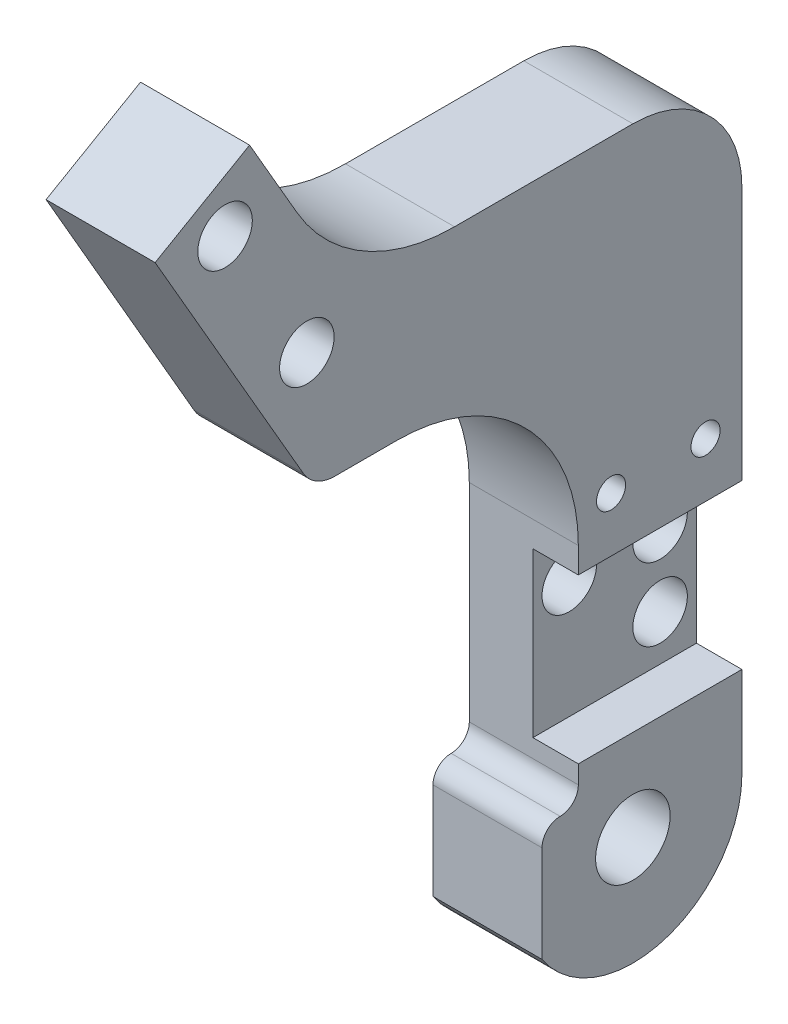
ISO-10303-21;
HEADER;
FILE_DESCRIPTION(('STEP AP214'),'2;1');
FILE_NAME('part.step','',(''),(''),'','','');
FILE_SCHEMA(('AUTOMOTIVE_DESIGN { 1 0 10303 214 1 1 1 1 }'));
ENDSEC;
DATA;
#1=APPLICATION_CONTEXT('core data for automotive mechanical design processes');
#2=APPLICATION_PROTOCOL_DEFINITION('international standard','automotive_design',2000,#1);
#3=PRODUCT_CONTEXT('',#1,'mechanical');
#4=PRODUCT('Part','Part','',(#3));
#5=PRODUCT_RELATED_PRODUCT_CATEGORY('part','',(#4));
#6=PRODUCT_DEFINITION_FORMATION('','',#4);
#7=PRODUCT_DEFINITION_CONTEXT('part definition',#1,'design');
#8=PRODUCT_DEFINITION('design','',#6,#7);
#9=PRODUCT_DEFINITION_SHAPE('','',#8);
#10=(LENGTH_UNIT() NAMED_UNIT(*) SI_UNIT(.MILLI.,.METRE.));
#11=(NAMED_UNIT(*) PLANE_ANGLE_UNIT() SI_UNIT($,.RADIAN.));
#12=(NAMED_UNIT(*) SI_UNIT($,.STERADIAN.) SOLID_ANGLE_UNIT());
#13=UNCERTAINTY_MEASURE_WITH_UNIT(LENGTH_MEASURE(1.E-05),#10,'distance_accuracy_value','');
#14=(GEOMETRIC_REPRESENTATION_CONTEXT(3) GLOBAL_UNCERTAINTY_ASSIGNED_CONTEXT((#13)) GLOBAL_UNIT_ASSIGNED_CONTEXT((#10,
#11,#12)) REPRESENTATION_CONTEXT('',''));
#15=CARTESIAN_POINT('',(0.,0.,0.));
#16=DIRECTION('',(0.,0.,1.));
#17=DIRECTION('',(1.,0.,0.));
#18=AXIS2_PLACEMENT_3D('',#15,#16,#17);
#19=CARTESIAN_POINT('',(0.,0.,0.));
#20=DIRECTION('',(-1.,0.,0.));
#21=DIRECTION('',(0.,0.,1.));
#22=AXIS2_PLACEMENT_3D('',#19,#20,#21);
#23=PLANE('',#22);
#24=CARTESIAN_POINT('',(0.,7.5,-4.));
#25=DIRECTION('',(1.,0.,0.));
#26=DIRECTION('',(0.,0.,-1.));
#27=AXIS2_PLACEMENT_3D('',#24,#25,#26);
#28=CIRCLE('',#27,1.5);
#29=CARTESIAN_POINT('',(0.,7.5,-5.5));
#30=VERTEX_POINT('',#29);
#31=EDGE_CURVE('E223',#30,#30,#28,.T.);
#32=ORIENTED_EDGE('',*,*,#31,.T.);
#33=EDGE_LOOP('',(#32));
#34=FACE_BOUND('',#33,.T.);
#35=CARTESIAN_POINT('',(0.,11.5,1.));
#36=DIRECTION('',(1.,0.,0.));
#37=DIRECTION('',(0.,0.,-1.));
#38=AXIS2_PLACEMENT_3D('',#35,#36,#37);
#39=CIRCLE('',#38,1.5);
#40=CARTESIAN_POINT('',(0.,11.5,-0.5));
#41=VERTEX_POINT('',#40);
#42=EDGE_CURVE('E229',#41,#41,#39,.T.);
#43=ORIENTED_EDGE('',*,*,#42,.T.);
#44=EDGE_LOOP('',(#43));
#45=FACE_BOUND('',#44,.T.);
#46=CARTESIAN_POINT('',(0.,39.8649364905389,22.4379491924311));
#47=DIRECTION('',(1.,0.,0.));
#48=DIRECTION('',(0.,0.,-1.));
#49=AXIS2_PLACEMENT_3D('',#46,#47,#48);
#50=CIRCLE('',#49,1.50000000000001);
#51=CARTESIAN_POINT('',(0.,39.8649364905389,20.9379491924311));
#52=VERTEX_POINT('',#51);
#53=EDGE_CURVE('E236',#52,#52,#50,.T.);
#54=ORIENTED_EDGE('',*,*,#53,.T.);
#55=EDGE_LOOP('',(#54));
#56=FACE_BOUND('',#55,.T.);
#57=DIRECTION('',(0.,-1.,0.));
#58=VECTOR('',#57,1.);
#59=CARTESIAN_POINT('',(0.,3.,5.));
#60=LINE('',#59,#58);
#61=CARTESIAN_POINT('',(0.,2.,5.));
#62=VERTEX_POINT('',#61);
#63=CARTESIAN_POINT('',(0.,-3.3166247903554,5.));
#64=VERTEX_POINT('',#63);
#65=EDGE_CURVE('E255',#62,#64,#60,.T.);
#66=ORIENTED_EDGE('',*,*,#65,.F.);
#67=CARTESIAN_POINT('',(0.,2.,4.));
#68=DIRECTION('',(-1.,0.,0.));
#69=DIRECTION('',(0.,0.,1.));
#70=AXIS2_PLACEMENT_3D('',#67,#68,#69);
#71=CIRCLE('',#70,1.);
#72=CARTESIAN_POINT('',(0.,3.,4.));
#73=VERTEX_POINT('',#72);
#74=EDGE_CURVE('E347',#62,#73,#71,.T.);
#75=ORIENTED_EDGE('',*,*,#74,.T.);
#76=CARTESIAN_POINT('',(0.,4.,4.));
#77=DIRECTION('',(-1.,0.,0.));
#78=DIRECTION('',(0.,0.,1.));
#79=AXIS2_PLACEMENT_3D('',#76,#77,#78);
#80=CIRCLE('',#79,1.);
#81=CARTESIAN_POINT('',(0.,4.,3.));
#82=VERTEX_POINT('',#81);
#83=EDGE_CURVE('E44',#73,#82,#80,.F.);
#84=ORIENTED_EDGE('',*,*,#83,.T.);
#85=DIRECTION('',(0.,-1.,0.));
#86=VECTOR('',#85,1.);
#87=CARTESIAN_POINT('',(0.,15.4051256642758,3.));
#88=LINE('',#87,#86);
#89=CARTESIAN_POINT('',(0.,15.4051256642758,3.));
#90=VERTEX_POINT('',#89);
#91=EDGE_CURVE('E305',#90,#82,#88,.T.);
#92=ORIENTED_EDGE('',*,*,#91,.F.);
#93=CARTESIAN_POINT('',(0.,15.4051256642758,13.));
#94=DIRECTION('',(-1.,0.,0.));
#95=DIRECTION('',(0.,0.,1.));
#96=AXIS2_PLACEMENT_3D('',#93,#94,#95);
#97=CIRCLE('',#96,10.);
#98=CARTESIAN_POINT('',(0.,25.4051256642758,13.));
#99=VERTEX_POINT('',#98);
#100=EDGE_CURVE('E303',#99,#90,#97,.T.);
#101=ORIENTED_EDGE('',*,*,#100,.F.);
#102=DIRECTION('',(0.,0.,-1.));
#103=VECTOR('',#102,1.);
#104=CARTESIAN_POINT('',(0.,25.4051256642759,16.3989745962154));
#105=LINE('',#104,#103);
#106=CARTESIAN_POINT('',(0.,25.4051256642759,16.3989745962154));
#107=VERTEX_POINT('',#106);
#108=EDGE_CURVE('E301',#107,#99,#105,.T.);
#109=ORIENTED_EDGE('',*,*,#108,.F.);
#110=CARTESIAN_POINT('',(0.,27.4051256642758,16.3989745962155));
#111=DIRECTION('',(1.,0.,0.));
#112=DIRECTION('',(0.,0.,-1.));
#113=AXIS2_PLACEMENT_3D('',#110,#111,#112);
#114=CIRCLE('',#113,1.99999999999995);
#115=CARTESIAN_POINT('',(0.,26.4051256642758,18.1310254037843));
#116=VERTEX_POINT('',#115);
#117=EDGE_CURVE('E299',#116,#107,#114,.T.);
#118=ORIENTED_EDGE('',*,*,#117,.F.);
#119=DIRECTION('',(0.,-0.866025403784435,-0.500000000000006));
#120=VECTOR('',#119,1.);
#121=CARTESIAN_POINT('',(0.,40.53,26.2860254037844));
#122=LINE('',#121,#120);
#123=CARTESIAN_POINT('',(0.,40.53,26.2860254037844));
#124=VERTEX_POINT('',#123);
#125=EDGE_CURVE('E297',#124,#116,#122,.T.);
#126=ORIENTED_EDGE('',*,*,#125,.F.);
#127=DIRECTION('',(0.,-0.500000000000005,0.866025403784436));
#128=VECTOR('',#127,1.);
#129=CARTESIAN_POINT('',(0.,43.53,21.0898729810778));
#130=LINE('',#129,#128);
#131=CARTESIAN_POINT('',(0.,43.53,21.0898729810778));
#132=VERTEX_POINT('',#131);
#133=EDGE_CURVE('E295',#132,#124,#130,.T.);
#134=ORIENTED_EDGE('',*,*,#133,.F.);
#135=DIRECTION('',(0.,0.866025403784436,0.500000000000004));
#136=VECTOR('',#135,1.);
#137=CARTESIAN_POINT('',(0.,39.,18.4744762616488));
#138=LINE('',#137,#136);
#139=CARTESIAN_POINT('',(0.,39.,18.4744762616488));
#140=VERTEX_POINT('',#139);
#141=EDGE_CURVE('E293',#140,#132,#138,.T.);
#142=ORIENTED_EDGE('',*,*,#141,.F.);
#143=CARTESIAN_POINT('',(0.,44.,9.8142222238044));
#144=DIRECTION('',(-1.,0.,0.));
#145=DIRECTION('',(0.,0.,1.));
#146=AXIS2_PLACEMENT_3D('',#143,#144,#145);
#147=CIRCLE('',#146,10.);
#148=CARTESIAN_POINT('',(0.,34.,9.81422222380439));
#149=VERTEX_POINT('',#148);
#150=EDGE_CURVE('E291',#149,#140,#147,.T.);
#151=ORIENTED_EDGE('',*,*,#150,.F.);
#152=DIRECTION('',(0.,0.,1.));
#153=VECTOR('',#152,1.);
#154=CARTESIAN_POINT('',(0.,34.,0.));
#155=LINE('',#154,#153);
#156=CARTESIAN_POINT('',(0.,34.,0.));
#157=VERTEX_POINT('',#156);
#158=EDGE_CURVE('E289',#157,#149,#155,.T.);
#159=ORIENTED_EDGE('',*,*,#158,.F.);
#160=CARTESIAN_POINT('',(0.,28.,0.));
#161=DIRECTION('',(1.,0.,0.));
#162=DIRECTION('',(0.,0.,-1.));
#163=AXIS2_PLACEMENT_3D('',#160,#161,#162);
#164=CIRCLE('',#163,6.);
#165=CARTESIAN_POINT('',(0.,28.,-6.));
#166=VERTEX_POINT('',#165);
#167=EDGE_CURVE('E287',#166,#157,#164,.T.);
#168=ORIENTED_EDGE('',*,*,#167,.F.);
#169=DIRECTION('',(0.,1.,0.));
#170=VECTOR('',#169,1.);
#171=CARTESIAN_POINT('',(0.,0.,-6.));
#172=LINE('',#171,#170);
#173=CARTESIAN_POINT('',(0.,0.,-6.));
#174=VERTEX_POINT('',#173);
#175=EDGE_CURVE('E285',#174,#166,#172,.T.);
#176=ORIENTED_EDGE('',*,*,#175,.F.);
#177=CARTESIAN_POINT('',(0.,0.,0.));
#178=DIRECTION('',(1.,0.,0.));
#179=DIRECTION('',(0.,0.,1.));
#180=AXIS2_PLACEMENT_3D('',#177,#178,#179);
#181=CIRCLE('',#180,6.);
#182=EDGE_CURVE('E248',#64,#174,#181,.T.);
#183=ORIENTED_EDGE('',*,*,#182,.F.);
#184=EDGE_LOOP('',(#66,#75,#84,#92,#101,#109,#118,#126,#134,#142,#151,#159,#168,#176,#183));
#185=FACE_BOUND('',#184,.T.);
#186=CARTESIAN_POINT('',(0.,0.,0.));
#187=DIRECTION('',(1.,0.,0.));
#188=DIRECTION('',(0.,0.,-1.));
#189=AXIS2_PLACEMENT_3D('',#186,#187,#188);
#190=CIRCLE('',#189,2.05);
#191=CARTESIAN_POINT('',(0.,0.,-2.05));
#192=VERTEX_POINT('',#191);
#193=EDGE_CURVE('E242',#192,#192,#190,.T.);
#194=ORIENTED_EDGE('',*,*,#193,.T.);
#195=EDGE_LOOP('',(#194));
#196=FACE_BOUND('',#195,.T.);
#197=CARTESIAN_POINT('',(0.,32.070707856479,17.9379491924311));
#198=DIRECTION('',(1.,0.,0.));
#199=DIRECTION('',(0.,0.,-1.));
#200=AXIS2_PLACEMENT_3D('',#197,#198,#199);
#201=CIRCLE('',#200,1.50000000000001);
#202=CARTESIAN_POINT('',(0.,32.070707856479,16.4379491924311));
#203=VERTEX_POINT('',#202);
#204=EDGE_CURVE('E232',#203,#203,#201,.T.);
#205=ORIENTED_EDGE('',*,*,#204,.T.);
#206=EDGE_LOOP('',(#205));
#207=FACE_BOUND('',#206,.T.);
#208=CARTESIAN_POINT('',(0.,11.5,-4.));
#209=DIRECTION('',(1.,0.,0.));
#210=DIRECTION('',(0.,0.,-1.));
#211=AXIS2_PLACEMENT_3D('',#208,#209,#210);
#212=CIRCLE('',#211,1.5);
#213=CARTESIAN_POINT('',(0.,11.5,-5.5));
#214=VERTEX_POINT('',#213);
#215=EDGE_CURVE('E226',#214,#214,#212,.T.);
#216=ORIENTED_EDGE('',*,*,#215,.T.);
#217=EDGE_LOOP('',(#216));
#218=FACE_BOUND('',#217,.T.);
#219=CARTESIAN_POINT('',(0.,17.,-4.));
#220=DIRECTION('',(-1.,0.,0.));
#221=DIRECTION('',(0.,0.,1.));
#222=AXIS2_PLACEMENT_3D('',#219,#220,#221);
#223=CIRCLE('',#222,0.799999999999993);
#224=CARTESIAN_POINT('',(0.,17.,-3.20000000000001));
#225=VERTEX_POINT('',#224);
#226=EDGE_CURVE('E219',#225,#225,#223,.T.);
#227=ORIENTED_EDGE('',*,*,#226,.F.);
#228=EDGE_LOOP('',(#227));
#229=FACE_BOUND('',#228,.T.);
#230=CARTESIAN_POINT('',(0.,17.,1.2));
#231=DIRECTION('',(-1.,0.,0.));
#232=DIRECTION('',(0.,0.,1.));
#233=AXIS2_PLACEMENT_3D('',#230,#231,#232);
#234=CIRCLE('',#233,0.799999999999993);
#235=CARTESIAN_POINT('',(0.,17.,1.99999999999999));
#236=VERTEX_POINT('',#235);
#237=EDGE_CURVE('E213',#236,#236,#234,.T.);
#238=ORIENTED_EDGE('',*,*,#237,.F.);
#239=EDGE_LOOP('',(#238));
#240=FACE_BOUND('',#239,.T.);
#241=CARTESIAN_POINT('',(0.,28.,0.));
#242=DIRECTION('',(1.,0.,0.));
#243=DIRECTION('',(0.,0.,-1.));
#244=AXIS2_PLACEMENT_3D('',#241,#242,#243);
#245=CIRCLE('',#244,5.);
#246=CARTESIAN_POINT('',(0.,28.,-5.));
#247=VERTEX_POINT('',#246);
#248=EDGE_CURVE('E192',#247,#247,#245,.T.);
#249=ORIENTED_EDGE('',*,*,#248,.T.);
#250=EDGE_LOOP('',(#249));
#251=FACE_BOUND('',#250,.T.);
#252=ADVANCED_FACE('F35',(#34,#45,#56,#185,#196,#207,#218,#229,#240,#251),#23,.T.);
#253=CARTESIAN_POINT('',(6.,0.,0.));
#254=DIRECTION('',(-1.,0.,0.));
#255=DIRECTION('',(0.,0.,1.));
#256=AXIS2_PLACEMENT_3D('',#253,#254,#255);
#257=PLANE('',#256);
#258=CARTESIAN_POINT('',(6.,0.,0.));
#259=DIRECTION('',(1.,0.,0.));
#260=DIRECTION('',(0.,0.,-1.));
#261=AXIS2_PLACEMENT_3D('',#258,#259,#260);
#262=CIRCLE('',#261,2.05);
#263=CARTESIAN_POINT('',(6.,0.,-2.05));
#264=VERTEX_POINT('',#263);
#265=EDGE_CURVE('E245',#264,#264,#262,.T.);
#266=ORIENTED_EDGE('',*,*,#265,.F.);
#267=EDGE_LOOP('',(#266));
#268=FACE_BOUND('',#267,.T.);
#269=DIRECTION('',(0.,0.,1.));
#270=VECTOR('',#269,1.);
#271=CARTESIAN_POINT('',(6.,5.,-6.));
#272=LINE('',#271,#270);
#273=CARTESIAN_POINT('',(6.,5.,-6.));
#274=VERTEX_POINT('',#273);
#275=CARTESIAN_POINT('',(6.,5.,3.));
#276=VERTEX_POINT('',#275);
#277=EDGE_CURVE('E179',#274,#276,#272,.T.);
#278=ORIENTED_EDGE('',*,*,#277,.T.);
#279=DIRECTION('',(0.,-1.,0.));
#280=VECTOR('',#279,1.);
#281=CARTESIAN_POINT('',(6.,15.4051256642758,3.));
#282=LINE('',#281,#280);
#283=CARTESIAN_POINT('',(6.,4.,3.));
#284=VERTEX_POINT('',#283);
#285=EDGE_CURVE('E276',#276,#284,#282,.T.);
#286=ORIENTED_EDGE('',*,*,#285,.T.);
#287=CARTESIAN_POINT('',(6.,4.,4.));
#288=DIRECTION('',(-1.,0.,0.));
#289=DIRECTION('',(0.,0.,1.));
#290=AXIS2_PLACEMENT_3D('',#287,#288,#289);
#291=CIRCLE('',#290,1.);
#292=CARTESIAN_POINT('',(6.,3.,4.));
#293=VERTEX_POINT('',#292);
#294=EDGE_CURVE('E11',#284,#293,#291,.T.);
#295=ORIENTED_EDGE('',*,*,#294,.T.);
#296=CARTESIAN_POINT('',(6.,2.,4.));
#297=DIRECTION('',(-1.,0.,0.));
#298=DIRECTION('',(0.,0.,1.));
#299=AXIS2_PLACEMENT_3D('',#296,#297,#298);
#300=CIRCLE('',#299,1.);
#301=CARTESIAN_POINT('',(6.,2.,5.));
#302=VERTEX_POINT('',#301);
#303=EDGE_CURVE('E349',#293,#302,#300,.F.);
#304=ORIENTED_EDGE('',*,*,#303,.T.);
#305=DIRECTION('',(0.,-1.,0.));
#306=VECTOR('',#305,1.);
#307=CARTESIAN_POINT('',(6.,3.,5.));
#308=LINE('',#307,#306);
#309=CARTESIAN_POINT('',(6.,-3.3166247903554,5.));
#310=VERTEX_POINT('',#309);
#311=EDGE_CURVE('E280',#302,#310,#308,.T.);
#312=ORIENTED_EDGE('',*,*,#311,.T.);
#313=CARTESIAN_POINT('',(6.,0.,0.));
#314=DIRECTION('',(1.,0.,0.));
#315=DIRECTION('',(0.,0.,1.));
#316=AXIS2_PLACEMENT_3D('',#313,#314,#315);
#317=CIRCLE('',#316,6.);
#318=CARTESIAN_POINT('',(6.,0.,-6.));
#319=VERTEX_POINT('',#318);
#320=EDGE_CURVE('E251',#310,#319,#317,.T.);
#321=ORIENTED_EDGE('',*,*,#320,.T.);
#322=DIRECTION('',(0.,1.,0.));
#323=VECTOR('',#322,1.);
#324=CARTESIAN_POINT('',(6.,0.,-6.));
#325=LINE('',#324,#323);
#326=EDGE_CURVE('E256',#319,#274,#325,.T.);
#327=ORIENTED_EDGE('',*,*,#326,.T.);
#328=EDGE_LOOP('',(#278,#286,#295,#304,#312,#321,#327));
#329=FACE_BOUND('',#328,.T.);
#330=ADVANCED_FACE('F425',(#268,#329),#257,.F.);
#331=CARTESIAN_POINT('',(6.,17.,1.2));
#332=DIRECTION('',(1.,0.,0.));
#333=DIRECTION('',(0.,0.,-1.));
#334=AXIS2_PLACEMENT_3D('',#331,#332,#333);
#335=CIRCLE('',#334,0.799999999999988);
#336=CARTESIAN_POINT('',(6.,17.,0.400000000000011));
#337=VERTEX_POINT('',#336);
#338=EDGE_CURVE('E210',#337,#337,#335,.T.);
#339=ORIENTED_EDGE('',*,*,#338,.F.);
#340=EDGE_LOOP('',(#339));
#341=FACE_BOUND('',#340,.T.);
#342=CARTESIAN_POINT('',(6.,17.,-4.));
#343=DIRECTION('',(1.,0.,0.));
#344=DIRECTION('',(0.,0.,-1.));
#345=AXIS2_PLACEMENT_3D('',#342,#343,#344);
#346=CIRCLE('',#345,0.799999999999988);
#347=CARTESIAN_POINT('',(6.,17.,-4.79999999999999));
#348=VERTEX_POINT('',#347);
#349=EDGE_CURVE('E216',#348,#348,#346,.T.);
#350=ORIENTED_EDGE('',*,*,#349,.F.);
#351=EDGE_LOOP('',(#350));
#352=FACE_BOUND('',#351,.T.);
#353=CARTESIAN_POINT('',(6.,32.070707856479,17.9379491924311));
#354=DIRECTION('',(1.,0.,0.));
#355=DIRECTION('',(0.,0.,-1.));
#356=AXIS2_PLACEMENT_3D('',#353,#354,#355);
#357=CIRCLE('',#356,1.50000000000001);
#358=CARTESIAN_POINT('',(6.,32.070707856479,16.4379491924311));
#359=VERTEX_POINT('',#358);
#360=EDGE_CURVE('E233',#359,#359,#357,.T.);
#361=ORIENTED_EDGE('',*,*,#360,.F.);
#362=EDGE_LOOP('',(#361));
#363=FACE_BOUND('',#362,.T.);
#364=CARTESIAN_POINT('',(6.,39.8649364905389,22.4379491924311));
#365=DIRECTION('',(1.,0.,0.));
#366=DIRECTION('',(0.,0.,-1.));
#367=AXIS2_PLACEMENT_3D('',#364,#365,#366);
#368=CIRCLE('',#367,1.50000000000001);
#369=CARTESIAN_POINT('',(6.,39.8649364905389,20.9379491924311));
#370=VERTEX_POINT('',#369);
#371=EDGE_CURVE('E239',#370,#370,#368,.T.);
#372=ORIENTED_EDGE('',*,*,#371,.F.);
#373=EDGE_LOOP('',(#372));
#374=FACE_BOUND('',#373,.T.);
#375=DIRECTION('',(0.,0.,-1.));
#376=VECTOR('',#375,1.);
#377=CARTESIAN_POINT('',(6.,14.,-6.));
#378=LINE('',#377,#376);
#379=CARTESIAN_POINT('',(6.,14.,3.));
#380=VERTEX_POINT('',#379);
#381=CARTESIAN_POINT('',(6.,14.,-6.));
#382=VERTEX_POINT('',#381);
#383=EDGE_CURVE('E187',#380,#382,#378,.T.);
#384=ORIENTED_EDGE('',*,*,#383,.T.);
#385=CARTESIAN_POINT('',(6.,28.,-6.));
#386=VERTEX_POINT('',#385);
#387=EDGE_CURVE('E254',#382,#386,#325,.T.);
#388=ORIENTED_EDGE('',*,*,#387,.T.);
#389=CARTESIAN_POINT('',(6.,28.,0.));
#390=DIRECTION('',(1.,0.,0.));
#391=DIRECTION('',(0.,0.,-1.));
#392=AXIS2_PLACEMENT_3D('',#389,#390,#391);
#393=CIRCLE('',#392,6.);
#394=CARTESIAN_POINT('',(6.,34.,0.));
#395=VERTEX_POINT('',#394);
#396=EDGE_CURVE('E258',#386,#395,#393,.T.);
#397=ORIENTED_EDGE('',*,*,#396,.T.);
#398=DIRECTION('',(0.,0.,1.));
#399=VECTOR('',#398,1.);
#400=CARTESIAN_POINT('',(6.,34.,0.));
#401=LINE('',#400,#399);
#402=CARTESIAN_POINT('',(6.,34.,9.81422222380439));
#403=VERTEX_POINT('',#402);
#404=EDGE_CURVE('E260',#395,#403,#401,.T.);
#405=ORIENTED_EDGE('',*,*,#404,.T.);
#406=CARTESIAN_POINT('',(6.,44.,9.8142222238044));
#407=DIRECTION('',(-1.,0.,0.));
#408=DIRECTION('',(0.,0.,1.));
#409=AXIS2_PLACEMENT_3D('',#406,#407,#408);
#410=CIRCLE('',#409,10.);
#411=CARTESIAN_POINT('',(6.,39.,18.4744762616488));
#412=VERTEX_POINT('',#411);
#413=EDGE_CURVE('E262',#403,#412,#410,.T.);
#414=ORIENTED_EDGE('',*,*,#413,.T.);
#415=DIRECTION('',(0.,0.866025403784436,0.500000000000004));
#416=VECTOR('',#415,1.);
#417=CARTESIAN_POINT('',(6.,39.,18.4744762616488));
#418=LINE('',#417,#416);
#419=CARTESIAN_POINT('',(6.,43.53,21.0898729810778));
#420=VERTEX_POINT('',#419);
#421=EDGE_CURVE('E264',#412,#420,#418,.T.);
#422=ORIENTED_EDGE('',*,*,#421,.T.);
#423=DIRECTION('',(0.,-0.500000000000005,0.866025403784436));
#424=VECTOR('',#423,1.);
#425=CARTESIAN_POINT('',(6.,43.53,21.0898729810778));
#426=LINE('',#425,#424);
#427=CARTESIAN_POINT('',(6.,40.53,26.2860254037844));
#428=VERTEX_POINT('',#427);
#429=EDGE_CURVE('E266',#420,#428,#426,.T.);
#430=ORIENTED_EDGE('',*,*,#429,.T.);
#431=DIRECTION('',(0.,-0.866025403784435,-0.500000000000006));
#432=VECTOR('',#431,1.);
#433=CARTESIAN_POINT('',(6.,40.53,26.2860254037844));
#434=LINE('',#433,#432);
#435=CARTESIAN_POINT('',(6.,26.4051256642758,18.1310254037843));
#436=VERTEX_POINT('',#435);
#437=EDGE_CURVE('E268',#428,#436,#434,.T.);
#438=ORIENTED_EDGE('',*,*,#437,.T.);
#439=CARTESIAN_POINT('',(6.,27.4051256642758,16.3989745962155));
#440=DIRECTION('',(1.,0.,0.));
#441=DIRECTION('',(0.,0.,-1.));
#442=AXIS2_PLACEMENT_3D('',#439,#440,#441);
#443=CIRCLE('',#442,1.99999999999995);
#444=CARTESIAN_POINT('',(6.,25.4051256642759,16.3989745962154));
#445=VERTEX_POINT('',#444);
#446=EDGE_CURVE('E270',#436,#445,#443,.T.);
#447=ORIENTED_EDGE('',*,*,#446,.T.);
#448=DIRECTION('',(0.,0.,-1.));
#449=VECTOR('',#448,1.);
#450=CARTESIAN_POINT('',(6.,25.4051256642759,16.3989745962154));
#451=LINE('',#450,#449);
#452=CARTESIAN_POINT('',(6.,25.4051256642758,13.));
#453=VERTEX_POINT('',#452);
#454=EDGE_CURVE('E272',#445,#453,#451,.T.);
#455=ORIENTED_EDGE('',*,*,#454,.T.);
#456=CARTESIAN_POINT('',(6.,15.4051256642758,13.));
#457=DIRECTION('',(-1.,0.,0.));
#458=DIRECTION('',(0.,0.,1.));
#459=AXIS2_PLACEMENT_3D('',#456,#457,#458);
#460=CIRCLE('',#459,10.);
#461=CARTESIAN_POINT('',(6.,15.4051256642758,3.));
#462=VERTEX_POINT('',#461);
#463=EDGE_CURVE('E274',#453,#462,#460,.T.);
#464=ORIENTED_EDGE('',*,*,#463,.T.);
#465=EDGE_CURVE('E277',#462,#380,#282,.T.);
#466=ORIENTED_EDGE('',*,*,#465,.T.);
#467=EDGE_LOOP('',(#384,#388,#397,#405,#414,#422,#430,#438,#447,#455,#464,#466));
#468=FACE_BOUND('',#467,.T.);
#469=ADVANCED_FACE('F428',(#341,#352,#363,#374,#468),#257,.F.);
#470=CARTESIAN_POINT('',(6.,0.,-6.));
#471=DIRECTION('',(0.,0.,1.));
#472=DIRECTION('',(0.,-1.,0.));
#473=AXIS2_PLACEMENT_3D('',#470,#471,#472);
#474=PLANE('',#473);
#475=DIRECTION('',(1.,0.,0.));
#476=VECTOR('',#475,1.);
#477=CARTESIAN_POINT('',(3.5,5.,-6.));
#478=LINE('',#477,#476);
#479=CARTESIAN_POINT('',(3.5,5.,-6.));
#480=VERTEX_POINT('',#479);
#481=EDGE_CURVE('E176',#480,#274,#478,.T.);
#482=ORIENTED_EDGE('',*,*,#481,.T.);
#483=ORIENTED_EDGE('',*,*,#326,.F.);
#484=DIRECTION('',(-1.,0.,0.));
#485=VECTOR('',#484,1.);
#486=CARTESIAN_POINT('',(6.,0.,-6.));
#487=LINE('',#486,#485);
#488=EDGE_CURVE('E341',#319,#174,#487,.T.);
#489=ORIENTED_EDGE('',*,*,#488,.T.);
#490=ORIENTED_EDGE('',*,*,#175,.T.);
#491=DIRECTION('',(-1.,0.,0.));
#492=VECTOR('',#491,1.);
#493=CARTESIAN_POINT('',(6.,28.,-6.));
#494=LINE('',#493,#492);
#495=EDGE_CURVE('E338',#386,#166,#494,.T.);
#496=ORIENTED_EDGE('',*,*,#495,.F.);
#497=ORIENTED_EDGE('',*,*,#387,.F.);
#498=DIRECTION('',(1.,0.,0.));
#499=VECTOR('',#498,1.);
#500=CARTESIAN_POINT('',(3.5,14.,-6.));
#501=LINE('',#500,#499);
#502=CARTESIAN_POINT('',(3.5,14.,-6.));
#503=VERTEX_POINT('',#502);
#504=EDGE_CURVE('E186',#503,#382,#501,.T.);
#505=ORIENTED_EDGE('',*,*,#504,.F.);
#506=DIRECTION('',(0.,-1.,0.));
#507=VECTOR('',#506,1.);
#508=CARTESIAN_POINT('',(3.5,5.,-6.));
#509=LINE('',#508,#507);
#510=EDGE_CURVE('E168',#503,#480,#509,.T.);
#511=ORIENTED_EDGE('',*,*,#510,.T.);
#512=EDGE_LOOP('',(#482,#483,#489,#490,#496,#497,#505,#511));
#513=FACE_BOUND('',#512,.T.);
#514=ADVANCED_FACE('F184',(#513),#474,.F.);
#515=CARTESIAN_POINT('',(6.,15.4051256642758,3.));
#516=DIRECTION('',(0.,0.,-1.));
#517=DIRECTION('',(0.,1.,0.));
#518=AXIS2_PLACEMENT_3D('',#515,#516,#517);
#519=PLANE('',#518);
#520=DIRECTION('',(1.,0.,0.));
#521=VECTOR('',#520,1.);
#522=CARTESIAN_POINT('',(3.5,5.,3.));
#523=LINE('',#522,#521);
#524=CARTESIAN_POINT('',(3.5,5.,3.));
#525=VERTEX_POINT('',#524);
#526=EDGE_CURVE('E182',#525,#276,#523,.T.);
#527=ORIENTED_EDGE('',*,*,#526,.F.);
#528=DIRECTION('',(0.,1.,0.));
#529=VECTOR('',#528,1.);
#530=CARTESIAN_POINT('',(3.5,5.,3.));
#531=LINE('',#530,#529);
#532=CARTESIAN_POINT('',(3.5,14.,3.));
#533=VERTEX_POINT('',#532);
#534=EDGE_CURVE('E171',#525,#533,#531,.T.);
#535=ORIENTED_EDGE('',*,*,#534,.T.);
#536=DIRECTION('',(1.,0.,0.));
#537=VECTOR('',#536,1.);
#538=CARTESIAN_POINT('',(3.5,14.,3.));
#539=LINE('',#538,#537);
#540=EDGE_CURVE('E200',#533,#380,#539,.T.);
#541=ORIENTED_EDGE('',*,*,#540,.T.);
#542=ORIENTED_EDGE('',*,*,#465,.F.);
#543=DIRECTION('',(-1.,0.,0.));
#544=VECTOR('',#543,1.);
#545=CARTESIAN_POINT('',(6.,15.4051256642758,3.));
#546=LINE('',#545,#544);
#547=EDGE_CURVE('E311',#462,#90,#546,.T.);
#548=ORIENTED_EDGE('',*,*,#547,.T.);
#549=ORIENTED_EDGE('',*,*,#91,.T.);
#550=DIRECTION('',(-1.,0.,0.));
#551=VECTOR('',#550,1.);
#552=CARTESIAN_POINT('',(6.,4.,3.));
#553=LINE('',#552,#551);
#554=EDGE_CURVE('E351',#82,#284,#553,.F.);
#555=ORIENTED_EDGE('',*,*,#554,.T.);
#556=ORIENTED_EDGE('',*,*,#285,.F.);
#557=EDGE_LOOP('',(#527,#535,#541,#542,#548,#549,#555,#556));
#558=FACE_BOUND('',#557,.T.);
#559=ADVANCED_FACE('F368',(#558),#519,.F.);
#560=CARTESIAN_POINT('',(6.,11.5,1.));
#561=DIRECTION('',(-1.,0.,0.));
#562=DIRECTION('',(0.,0.,1.));
#563=AXIS2_PLACEMENT_3D('',#560,#561,#562);
#564=CYLINDRICAL_SURFACE('',#563,1.5);
#565=ORIENTED_EDGE('',*,*,#42,.F.);
#566=EDGE_LOOP('',(#565));
#567=FACE_BOUND('',#566,.T.);
#568=CARTESIAN_POINT('',(3.5,11.5,1.));
#569=DIRECTION('',(1.,0.,0.));
#570=DIRECTION('',(0.,0.,-1.));
#571=AXIS2_PLACEMENT_3D('',#568,#569,#570);
#572=CIRCLE('',#571,1.5);
#573=CARTESIAN_POINT('',(3.5,11.5,-0.5));
#574=VERTEX_POINT('',#573);
#575=EDGE_CURVE('E207',#574,#574,#572,.T.);
#576=ORIENTED_EDGE('',*,*,#575,.T.);
#577=EDGE_LOOP('',(#576));
#578=FACE_BOUND('',#577,.T.);
#579=ADVANCED_FACE('F457',(#567,#578),#564,.F.);
#580=CARTESIAN_POINT('',(6.,11.5,-4.));
#581=DIRECTION('',(-1.,0.,0.));
#582=DIRECTION('',(0.,0.,1.));
#583=AXIS2_PLACEMENT_3D('',#580,#581,#582);
#584=CYLINDRICAL_SURFACE('',#583,1.5);
#585=ORIENTED_EDGE('',*,*,#215,.F.);
#586=EDGE_LOOP('',(#585));
#587=FACE_BOUND('',#586,.T.);
#588=CARTESIAN_POINT('',(3.5,11.5,-4.));
#589=DIRECTION('',(1.,0.,0.));
#590=DIRECTION('',(0.,0.,-1.));
#591=AXIS2_PLACEMENT_3D('',#588,#589,#590);
#592=CIRCLE('',#591,1.5);
#593=CARTESIAN_POINT('',(3.5,11.5,-5.5));
#594=VERTEX_POINT('',#593);
#595=EDGE_CURVE('E204',#594,#594,#592,.T.);
#596=ORIENTED_EDGE('',*,*,#595,.T.);
#597=EDGE_LOOP('',(#596));
#598=FACE_BOUND('',#597,.T.);
#599=ADVANCED_FACE('F570',(#587,#598),#584,.F.);
#600=CARTESIAN_POINT('',(6.,7.5,-4.));
#601=DIRECTION('',(-1.,0.,0.));
#602=DIRECTION('',(0.,0.,1.));
#603=AXIS2_PLACEMENT_3D('',#600,#601,#602);
#604=CYLINDRICAL_SURFACE('',#603,1.5);
#605=ORIENTED_EDGE('',*,*,#31,.F.);
#606=EDGE_LOOP('',(#605));
#607=FACE_BOUND('',#606,.T.);
#608=CARTESIAN_POINT('',(3.5,7.5,-4.));
#609=DIRECTION('',(1.,0.,0.));
#610=DIRECTION('',(0.,0.,-1.));
#611=AXIS2_PLACEMENT_3D('',#608,#609,#610);
#612=CIRCLE('',#611,1.5);
#613=CARTESIAN_POINT('',(3.5,7.5,-5.5));
#614=VERTEX_POINT('',#613);
#615=EDGE_CURVE('E39',#614,#614,#612,.T.);
#616=ORIENTED_EDGE('',*,*,#615,.T.);
#617=EDGE_LOOP('',(#616));
#618=FACE_BOUND('',#617,.T.);
#619=ADVANCED_FACE('F479',(#607,#618),#604,.F.);
#620=CARTESIAN_POINT('',(6.,0.,0.));
#621=DIRECTION('',(-1.,0.,0.));
#622=DIRECTION('',(0.,0.,1.));
#623=AXIS2_PLACEMENT_3D('',#620,#621,#622);
#624=CYLINDRICAL_SURFACE('',#623,6.);
#625=ORIENTED_EDGE('',*,*,#182,.T.);
#626=ORIENTED_EDGE('',*,*,#488,.F.);
#627=ORIENTED_EDGE('',*,*,#320,.F.);
#628=DIRECTION('',(-1.,0.,0.));
#629=VECTOR('',#628,1.);
#630=CARTESIAN_POINT('',(6.,-3.3166247903554,5.));
#631=LINE('',#630,#629);
#632=EDGE_CURVE('E282',#310,#64,#631,.T.);
#633=ORIENTED_EDGE('',*,*,#632,.T.);
#634=EDGE_LOOP('',(#625,#626,#627,#633));
#635=FACE_BOUND('',#634,.T.);
#636=ADVANCED_FACE('F419',(#635),#624,.T.);
#637=CARTESIAN_POINT('',(6.,28.,0.));
#638=DIRECTION('',(-1.,0.,0.));
#639=DIRECTION('',(0.,0.,1.));
#640=AXIS2_PLACEMENT_3D('',#637,#638,#639);
#641=CYLINDRICAL_SURFACE('',#640,6.);
#642=ORIENTED_EDGE('',*,*,#167,.T.);
#643=DIRECTION('',(-1.,0.,0.));
#644=VECTOR('',#643,1.);
#645=CARTESIAN_POINT('',(6.,34.,0.));
#646=LINE('',#645,#644);
#647=EDGE_CURVE('E335',#395,#157,#646,.T.);
#648=ORIENTED_EDGE('',*,*,#647,.F.);
#649=ORIENTED_EDGE('',*,*,#396,.F.);
#650=ORIENTED_EDGE('',*,*,#495,.T.);
#651=EDGE_LOOP('',(#642,#648,#649,#650));
#652=FACE_BOUND('',#651,.T.);
#653=ADVANCED_FACE('F414',(#652),#641,.T.);
#654=CARTESIAN_POINT('',(6.,34.,0.));
#655=DIRECTION('',(0.,-1.,0.));
#656=DIRECTION('',(0.,0.,-1.));
#657=AXIS2_PLACEMENT_3D('',#654,#655,#656);
#658=PLANE('',#657);
#659=ORIENTED_EDGE('',*,*,#158,.T.);
#660=DIRECTION('',(-1.,0.,0.));
#661=VECTOR('',#660,1.);
#662=CARTESIAN_POINT('',(6.,34.,9.81422222380439));
#663=LINE('',#662,#661);
#664=EDGE_CURVE('E332',#403,#149,#663,.T.);
#665=ORIENTED_EDGE('',*,*,#664,.F.);
#666=ORIENTED_EDGE('',*,*,#404,.F.);
#667=ORIENTED_EDGE('',*,*,#647,.T.);
#668=EDGE_LOOP('',(#659,#665,#666,#667));
#669=FACE_BOUND('',#668,.T.);
#670=ADVANCED_FACE('F409',(#669),#658,.F.);
#671=CARTESIAN_POINT('',(6.,44.,9.8142222238044));
#672=DIRECTION('',(-1.,0.,0.));
#673=DIRECTION('',(0.,0.,1.));
#674=AXIS2_PLACEMENT_3D('',#671,#672,#673);
#675=CYLINDRICAL_SURFACE('',#674,10.);
#676=ORIENTED_EDGE('',*,*,#150,.T.);
#677=DIRECTION('',(-1.,0.,0.));
#678=VECTOR('',#677,1.);
#679=CARTESIAN_POINT('',(6.,39.,18.4744762616488));
#680=LINE('',#679,#678);
#681=EDGE_CURVE('E329',#412,#140,#680,.T.);
#682=ORIENTED_EDGE('',*,*,#681,.F.);
#683=ORIENTED_EDGE('',*,*,#413,.F.);
#684=ORIENTED_EDGE('',*,*,#664,.T.);
#685=EDGE_LOOP('',(#676,#682,#683,#684));
#686=FACE_BOUND('',#685,.T.);
#687=ADVANCED_FACE('F404',(#686),#675,.F.);
#688=CARTESIAN_POINT('',(6.,39.,18.4744762616488));
#689=DIRECTION('',(0.,-0.500000000000004,0.866025403784436));
#690=DIRECTION('',(0.,-0.866025403784436,-0.500000000000004));
#691=AXIS2_PLACEMENT_3D('',#688,#689,#690);
#692=PLANE('',#691);
#693=ORIENTED_EDGE('',*,*,#141,.T.);
#694=DIRECTION('',(-1.,0.,0.));
#695=VECTOR('',#694,1.);
#696=CARTESIAN_POINT('',(6.,43.53,21.0898729810778));
#697=LINE('',#696,#695);
#698=EDGE_CURVE('E326',#420,#132,#697,.T.);
#699=ORIENTED_EDGE('',*,*,#698,.F.);
#700=ORIENTED_EDGE('',*,*,#421,.F.);
#701=ORIENTED_EDGE('',*,*,#681,.T.);
#702=EDGE_LOOP('',(#693,#699,#700,#701));
#703=FACE_BOUND('',#702,.T.);
#704=ADVANCED_FACE('F400',(#703),#692,.F.);
#705=CARTESIAN_POINT('',(6.,43.53,21.0898729810778));
#706=DIRECTION('',(0.,-0.866025403784436,-0.500000000000005));
#707=DIRECTION('',(0.,0.500000000000005,-0.866025403784436));
#708=AXIS2_PLACEMENT_3D('',#705,#706,#707);
#709=PLANE('',#708);
#710=ORIENTED_EDGE('',*,*,#133,.T.);
#711=DIRECTION('',(-1.,0.,0.));
#712=VECTOR('',#711,1.);
#713=CARTESIAN_POINT('',(6.,40.53,26.2860254037844));
#714=LINE('',#713,#712);
#715=EDGE_CURVE('E323',#428,#124,#714,.T.);
#716=ORIENTED_EDGE('',*,*,#715,.F.);
#717=ORIENTED_EDGE('',*,*,#429,.F.);
#718=ORIENTED_EDGE('',*,*,#698,.T.);
#719=EDGE_LOOP('',(#710,#716,#717,#718));
#720=FACE_BOUND('',#719,.T.);
#721=ADVANCED_FACE('F395',(#720),#709,.F.);
#722=CARTESIAN_POINT('',(6.,40.53,26.2860254037844));
#723=DIRECTION('',(0.,0.500000000000006,-0.866025403784435));
#724=DIRECTION('',(0.,0.866025403784435,0.500000000000006));
#725=AXIS2_PLACEMENT_3D('',#722,#723,#724);
#726=PLANE('',#725);
#727=ORIENTED_EDGE('',*,*,#125,.T.);
#728=DIRECTION('',(-1.,0.,0.));
#729=VECTOR('',#728,1.);
#730=CARTESIAN_POINT('',(6.,26.4051256642758,18.1310254037843));
#731=LINE('',#730,#729);
#732=EDGE_CURVE('E320',#436,#116,#731,.T.);
#733=ORIENTED_EDGE('',*,*,#732,.F.);
#734=ORIENTED_EDGE('',*,*,#437,.F.);
#735=ORIENTED_EDGE('',*,*,#715,.T.);
#736=EDGE_LOOP('',(#727,#733,#734,#735));
#737=FACE_BOUND('',#736,.T.);
#738=ADVANCED_FACE('F389',(#737),#726,.F.);
#739=CARTESIAN_POINT('',(6.,27.4051256642758,16.3989745962155));
#740=DIRECTION('',(-1.,0.,0.));
#741=DIRECTION('',(0.,0.,1.));
#742=AXIS2_PLACEMENT_3D('',#739,#740,#741);
#743=CYLINDRICAL_SURFACE('',#742,1.99999999999995);
#744=ORIENTED_EDGE('',*,*,#117,.T.);
#745=DIRECTION('',(-1.,0.,0.));
#746=VECTOR('',#745,1.);
#747=CARTESIAN_POINT('',(6.,25.4051256642759,16.3989745962154));
#748=LINE('',#747,#746);
#749=EDGE_CURVE('E317',#445,#107,#748,.T.);
#750=ORIENTED_EDGE('',*,*,#749,.F.);
#751=ORIENTED_EDGE('',*,*,#446,.F.);
#752=ORIENTED_EDGE('',*,*,#732,.T.);
#753=EDGE_LOOP('',(#744,#750,#751,#752));
#754=FACE_BOUND('',#753,.T.);
#755=ADVANCED_FACE('F385',(#754),#743,.T.);
#756=CARTESIAN_POINT('',(6.,25.4051256642759,16.3989745962154));
#757=DIRECTION('',(0.,1.,0.));
#758=DIRECTION('',(0.,0.,1.));
#759=AXIS2_PLACEMENT_3D('',#756,#757,#758);
#760=PLANE('',#759);
#761=ORIENTED_EDGE('',*,*,#108,.T.);
#762=DIRECTION('',(-1.,0.,0.));
#763=VECTOR('',#762,1.);
#764=CARTESIAN_POINT('',(6.,25.4051256642758,13.));
#765=LINE('',#764,#763);
#766=EDGE_CURVE('E314',#453,#99,#765,.T.);
#767=ORIENTED_EDGE('',*,*,#766,.F.);
#768=ORIENTED_EDGE('',*,*,#454,.F.);
#769=ORIENTED_EDGE('',*,*,#749,.T.);
#770=EDGE_LOOP('',(#761,#767,#768,#769));
#771=FACE_BOUND('',#770,.T.);
#772=ADVANCED_FACE('F380',(#771),#760,.F.);
#773=CARTESIAN_POINT('',(6.,15.4051256642758,13.));
#774=DIRECTION('',(-1.,0.,0.));
#775=DIRECTION('',(0.,0.,1.));
#776=AXIS2_PLACEMENT_3D('',#773,#774,#775);
#777=CYLINDRICAL_SURFACE('',#776,10.);
#778=ORIENTED_EDGE('',*,*,#100,.T.);
#779=ORIENTED_EDGE('',*,*,#547,.F.);
#780=ORIENTED_EDGE('',*,*,#463,.F.);
#781=ORIENTED_EDGE('',*,*,#766,.T.);
#782=EDGE_LOOP('',(#778,#779,#780,#781));
#783=FACE_BOUND('',#782,.T.);
#784=ADVANCED_FACE('F374',(#783),#777,.F.);
#785=CARTESIAN_POINT('',(6.,3.,5.));
#786=DIRECTION('',(0.,0.,-1.));
#787=DIRECTION('',(0.,1.,0.));
#788=AXIS2_PLACEMENT_3D('',#785,#786,#787);
#789=PLANE('',#788);
#790=ORIENTED_EDGE('',*,*,#311,.F.);
#791=DIRECTION('',(-1.,0.,0.));
#792=VECTOR('',#791,1.);
#793=CARTESIAN_POINT('',(6.,2.,5.));
#794=LINE('',#793,#792);
#795=EDGE_CURVE('E344',#302,#62,#794,.T.);
#796=ORIENTED_EDGE('',*,*,#795,.T.);
#797=ORIENTED_EDGE('',*,*,#65,.T.);
#798=ORIENTED_EDGE('',*,*,#632,.F.);
#799=EDGE_LOOP('',(#790,#796,#797,#798));
#800=FACE_BOUND('',#799,.T.);
#801=ADVANCED_FACE('F424',(#800),#789,.F.);
#802=CARTESIAN_POINT('',(6.,0.,0.));
#803=DIRECTION('',(-1.,0.,0.));
#804=DIRECTION('',(0.,0.,1.));
#805=AXIS2_PLACEMENT_3D('',#802,#803,#804);
#806=CYLINDRICAL_SURFACE('',#805,2.05);
#807=ORIENTED_EDGE('',*,*,#265,.T.);
#808=EDGE_LOOP('',(#807));
#809=FACE_BOUND('',#808,.T.);
#810=ORIENTED_EDGE('',*,*,#193,.F.);
#811=EDGE_LOOP('',(#810));
#812=FACE_BOUND('',#811,.T.);
#813=ADVANCED_FACE('F454',(#809,#812),#806,.F.);
#814=CARTESIAN_POINT('',(6.,39.8649364905389,22.4379491924311));
#815=DIRECTION('',(-1.,0.,0.));
#816=DIRECTION('',(0.,0.,1.));
#817=AXIS2_PLACEMENT_3D('',#814,#815,#816);
#818=CYLINDRICAL_SURFACE('',#817,1.50000000000001);
#819=ORIENTED_EDGE('',*,*,#371,.T.);
#820=EDGE_LOOP('',(#819));
#821=FACE_BOUND('',#820,.T.);
#822=ORIENTED_EDGE('',*,*,#53,.F.);
#823=EDGE_LOOP('',(#822));
#824=FACE_BOUND('',#823,.T.);
#825=ADVANCED_FACE('F492',(#821,#824),#818,.F.);
#826=CARTESIAN_POINT('',(6.,32.070707856479,17.9379491924311));
#827=DIRECTION('',(-1.,0.,0.));
#828=DIRECTION('',(0.,0.,1.));
#829=AXIS2_PLACEMENT_3D('',#826,#827,#828);
#830=CYLINDRICAL_SURFACE('',#829,1.50000000000001);
#831=ORIENTED_EDGE('',*,*,#360,.T.);
#832=EDGE_LOOP('',(#831));
#833=FACE_BOUND('',#832,.T.);
#834=ORIENTED_EDGE('',*,*,#204,.F.);
#835=EDGE_LOOP('',(#834));
#836=FACE_BOUND('',#835,.T.);
#837=ADVANCED_FACE('F488',(#833,#836),#830,.F.);
#838=CARTESIAN_POINT('',(6.,4.,4.));
#839=DIRECTION('',(1.,0.,0.));
#840=DIRECTION('',(0.,0.,-1.));
#841=AXIS2_PLACEMENT_3D('',#838,#839,#840);
#842=CYLINDRICAL_SURFACE('',#841,1.);
#843=DIRECTION('',(-1.,0.,0.));
#844=VECTOR('',#843,1.);
#845=CARTESIAN_POINT('',(0.,3.,4.));
#846=LINE('',#845,#844);
#847=EDGE_CURVE('E222',#293,#73,#846,.T.);
#848=ORIENTED_EDGE('',*,*,#847,.F.);
#849=ORIENTED_EDGE('',*,*,#294,.F.);
#850=ORIENTED_EDGE('',*,*,#554,.F.);
#851=ORIENTED_EDGE('',*,*,#83,.F.);
#852=EDGE_LOOP('',(#848,#849,#850,#851));
#853=FACE_BOUND('',#852,.T.);
#854=ADVANCED_FACE('F37',(#853),#842,.F.);
#855=CARTESIAN_POINT('',(6.,2.,4.));
#856=DIRECTION('',(-1.,0.,0.));
#857=DIRECTION('',(0.,0.,1.));
#858=AXIS2_PLACEMENT_3D('',#855,#856,#857);
#859=CYLINDRICAL_SURFACE('',#858,1.);
#860=ORIENTED_EDGE('',*,*,#303,.F.);
#861=ORIENTED_EDGE('',*,*,#847,.T.);
#862=ORIENTED_EDGE('',*,*,#74,.F.);
#863=ORIENTED_EDGE('',*,*,#795,.F.);
#864=EDGE_LOOP('',(#860,#861,#862,#863));
#865=FACE_BOUND('',#864,.T.);
#866=ADVANCED_FACE('F357',(#865),#859,.T.);
#867=CARTESIAN_POINT('',(6.,17.,-4.));
#868=DIRECTION('',(1.,0.,0.));
#869=DIRECTION('',(0.,0.,-1.));
#870=AXIS2_PLACEMENT_3D('',#867,#868,#869);
#871=CYLINDRICAL_SURFACE('',#870,0.799999999999993);
#872=ORIENTED_EDGE('',*,*,#349,.T.);
#873=EDGE_LOOP('',(#872));
#874=FACE_BOUND('',#873,.T.);
#875=ORIENTED_EDGE('',*,*,#226,.T.);
#876=EDGE_LOOP('',(#875));
#877=FACE_BOUND('',#876,.T.);
#878=ADVANCED_FACE('F481',(#874,#877),#871,.F.);
#879=CARTESIAN_POINT('',(6.,17.,1.2));
#880=DIRECTION('',(1.,0.,0.));
#881=DIRECTION('',(0.,0.,-1.));
#882=AXIS2_PLACEMENT_3D('',#879,#880,#881);
#883=CYLINDRICAL_SURFACE('',#882,0.799999999999993);
#884=ORIENTED_EDGE('',*,*,#338,.T.);
#885=EDGE_LOOP('',(#884));
#886=FACE_BOUND('',#885,.T.);
#887=ORIENTED_EDGE('',*,*,#237,.T.);
#888=EDGE_LOOP('',(#887));
#889=FACE_BOUND('',#888,.T.);
#890=ADVANCED_FACE('F439',(#886,#889),#883,.F.);
#891=CARTESIAN_POINT('',(3.5,5.,-6.));
#892=DIRECTION('',(0.,1.,0.));
#893=DIRECTION('',(0.,0.,1.));
#894=AXIS2_PLACEMENT_3D('',#891,#892,#893);
#895=PLANE('',#894);
#896=ORIENTED_EDGE('',*,*,#277,.F.);
#897=ORIENTED_EDGE('',*,*,#481,.F.);
#898=DIRECTION('',(0.,0.,1.));
#899=VECTOR('',#898,1.);
#900=CARTESIAN_POINT('',(3.5,5.,-6.));
#901=LINE('',#900,#899);
#902=EDGE_CURVE('E164',#480,#525,#901,.T.);
#903=ORIENTED_EDGE('',*,*,#902,.T.);
#904=ORIENTED_EDGE('',*,*,#526,.T.);
#905=EDGE_LOOP('',(#896,#897,#903,#904));
#906=FACE_BOUND('',#905,.T.);
#907=ADVANCED_FACE('F177',(#906),#895,.T.);
#908=CARTESIAN_POINT('',(3.5,14.,-6.));
#909=DIRECTION('',(0.,-1.,0.));
#910=DIRECTION('',(0.,0.,-1.));
#911=AXIS2_PLACEMENT_3D('',#908,#909,#910);
#912=PLANE('',#911);
#913=ORIENTED_EDGE('',*,*,#383,.F.);
#914=ORIENTED_EDGE('',*,*,#540,.F.);
#915=DIRECTION('',(0.,0.,-1.));
#916=VECTOR('',#915,1.);
#917=CARTESIAN_POINT('',(3.5,14.,-6.));
#918=LINE('',#917,#916);
#919=EDGE_CURVE('E52',#533,#503,#918,.T.);
#920=ORIENTED_EDGE('',*,*,#919,.T.);
#921=ORIENTED_EDGE('',*,*,#504,.T.);
#922=EDGE_LOOP('',(#913,#914,#920,#921));
#923=FACE_BOUND('',#922,.T.);
#924=ADVANCED_FACE('F429',(#923),#912,.T.);
#925=CARTESIAN_POINT('',(3.5,0.,0.));
#926=DIRECTION('',(1.,0.,0.));
#927=DIRECTION('',(0.,0.,-1.));
#928=AXIS2_PLACEMENT_3D('',#925,#926,#927);
#929=PLANE('',#928);
#930=ORIENTED_EDGE('',*,*,#575,.F.);
#931=EDGE_LOOP('',(#930));
#932=FACE_BOUND('',#931,.T.);
#933=ORIENTED_EDGE('',*,*,#595,.F.);
#934=EDGE_LOOP('',(#933));
#935=FACE_BOUND('',#934,.T.);
#936=ORIENTED_EDGE('',*,*,#615,.F.);
#937=EDGE_LOOP('',(#936));
#938=FACE_BOUND('',#937,.T.);
#939=ORIENTED_EDGE('',*,*,#510,.F.);
#940=ORIENTED_EDGE('',*,*,#919,.F.);
#941=ORIENTED_EDGE('',*,*,#534,.F.);
#942=ORIENTED_EDGE('',*,*,#902,.F.);
#943=EDGE_LOOP('',(#939,#940,#941,#942));
#944=FACE_BOUND('',#943,.T.);
#945=ADVANCED_FACE('F166',(#932,#935,#938,#944),#929,.T.);
#946=CARTESIAN_POINT('',(4.,28.,0.));
#947=DIRECTION('',(-1.,0.,0.));
#948=DIRECTION('',(0.,0.,1.));
#949=AXIS2_PLACEMENT_3D('',#946,#947,#948);
#950=CYLINDRICAL_SURFACE('',#949,5.);
#951=CARTESIAN_POINT('',(4.,28.,0.));
#952=DIRECTION('',(1.,0.,0.));
#953=DIRECTION('',(0.,0.,-1.));
#954=AXIS2_PLACEMENT_3D('',#951,#952,#953);
#955=CIRCLE('',#954,5.);
#956=CARTESIAN_POINT('',(4.,28.,-5.));
#957=VERTEX_POINT('',#956);
#958=EDGE_CURVE('E197',#957,#957,#955,.T.);
#959=ORIENTED_EDGE('',*,*,#958,.T.);
#960=EDGE_LOOP('',(#959));
#961=FACE_BOUND('',#960,.T.);
#962=ORIENTED_EDGE('',*,*,#248,.F.);
#963=EDGE_LOOP('',(#962));
#964=FACE_BOUND('',#963,.T.);
#965=ADVANCED_FACE('F436',(#961,#964),#950,.F.);
#966=CARTESIAN_POINT('',(4.,28.,0.));
#967=DIRECTION('',(1.,0.,0.));
#968=DIRECTION('',(0.,0.,-1.));
#969=AXIS2_PLACEMENT_3D('',#966,#967,#968);
#970=PLANE('',#969);
#971=ORIENTED_EDGE('',*,*,#958,.F.);
#972=EDGE_LOOP('',(#971));
#973=FACE_BOUND('',#972,.T.);
#974=ADVANCED_FACE('F526',(#973),#970,.F.);
#975=CLOSED_SHELL('',(#252,#330,#469,#514,#559,#579,#599,#619,#636,#653,#670,#687,#704,#721,
#738,#755,#772,#784,#801,#813,#825,#837,#854,#866,#878,#890,#907,#924,#945,#965,#974));
#976=MANIFOLD_SOLID_BREP('B2',#975);
#977=ADVANCED_BREP_SHAPE_REPRESENTATION('',(#18,#976),#14);
#978=SHAPE_DEFINITION_REPRESENTATION(#9,#977);
ENDSEC;
END-ISO-10303-21;
